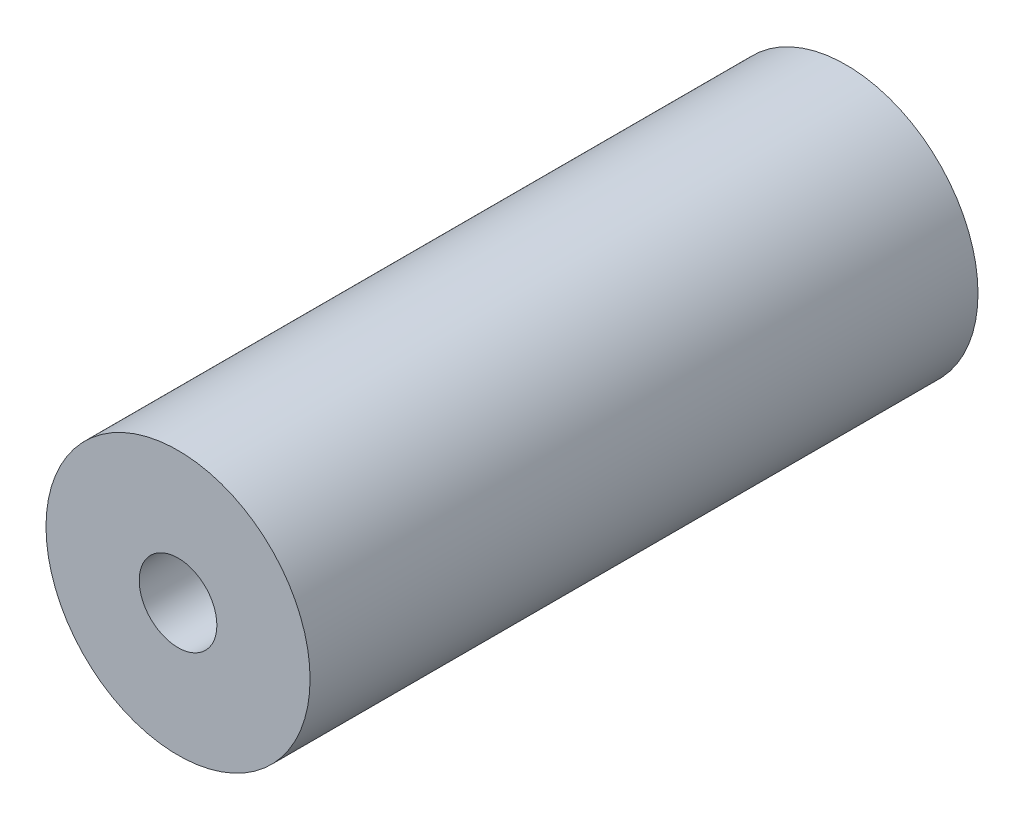
ISO-10303-21;
HEADER;
FILE_DESCRIPTION(('STEP AP214'),'2;1');
FILE_NAME('part.step','',(''),(''),'','','');
FILE_SCHEMA(('AUTOMOTIVE_DESIGN { 1 0 10303 214 1 1 1 1 }'));
ENDSEC;
DATA;
#1=APPLICATION_CONTEXT('core data for automotive mechanical design processes');
#2=APPLICATION_PROTOCOL_DEFINITION('international standard','automotive_design',2000,#1);
#3=PRODUCT_CONTEXT('',#1,'mechanical');
#4=PRODUCT('Part','Part','',(#3));
#5=PRODUCT_RELATED_PRODUCT_CATEGORY('part','',(#4));
#6=PRODUCT_DEFINITION_FORMATION('','',#4);
#7=PRODUCT_DEFINITION_CONTEXT('part definition',#1,'design');
#8=PRODUCT_DEFINITION('design','',#6,#7);
#9=PRODUCT_DEFINITION_SHAPE('','',#8);
#10=(LENGTH_UNIT() NAMED_UNIT(*) SI_UNIT(.MILLI.,.METRE.));
#11=(NAMED_UNIT(*) PLANE_ANGLE_UNIT() SI_UNIT($,.RADIAN.));
#12=(NAMED_UNIT(*) SI_UNIT($,.STERADIAN.) SOLID_ANGLE_UNIT());
#13=UNCERTAINTY_MEASURE_WITH_UNIT(LENGTH_MEASURE(1.E-05),#10,'distance_accuracy_value','');
#14=(GEOMETRIC_REPRESENTATION_CONTEXT(3) GLOBAL_UNCERTAINTY_ASSIGNED_CONTEXT((#13)) GLOBAL_UNIT_ASSIGNED_CONTEXT((#10,
#11,#12)) REPRESENTATION_CONTEXT('',''));
#15=CARTESIAN_POINT('',(0.,0.,0.));
#16=DIRECTION('',(0.,0.,1.));
#17=DIRECTION('',(1.,0.,0.));
#18=AXIS2_PLACEMENT_3D('',#15,#16,#17);
#19=CARTESIAN_POINT('',(0.,0.,43.));
#20=DIRECTION('',(0.,0.,1.));
#21=DIRECTION('',(1.,0.,0.));
#22=AXIS2_PLACEMENT_3D('',#19,#20,#21);
#23=PLANE('',#22);
#24=CARTESIAN_POINT('',(0.,0.,43.));
#25=DIRECTION('',(0.,0.,1.));
#26=DIRECTION('',(1.,0.,0.));
#27=AXIS2_PLACEMENT_3D('',#24,#25,#26);
#28=CIRCLE('',#27,17.);
#29=CARTESIAN_POINT('',(17.,0.,43.));
#30=VERTEX_POINT('',#29);
#31=EDGE_CURVE('E10',#30,#30,#28,.T.);
#32=ORIENTED_EDGE('',*,*,#31,.T.);
#33=EDGE_LOOP('',(#32));
#34=FACE_BOUND('',#33,.T.);
#35=CARTESIAN_POINT('',(0.,0.,43.));
#36=DIRECTION('',(0.,0.,1.));
#37=DIRECTION('',(1.,0.,0.));
#38=AXIS2_PLACEMENT_3D('',#35,#36,#37);
#39=CIRCLE('',#38,5.);
#40=CARTESIAN_POINT('',(5.,0.,43.));
#41=VERTEX_POINT('',#40);
#42=EDGE_CURVE('E50',#41,#41,#39,.T.);
#43=ORIENTED_EDGE('',*,*,#42,.F.);
#44=EDGE_LOOP('',(#43));
#45=FACE_BOUND('',#44,.T.);
#46=ADVANCED_FACE('F37',(#34,#45),#23,.T.);
#47=CARTESIAN_POINT('',(0.,0.,-43.));
#48=DIRECTION('',(0.,0.,1.));
#49=DIRECTION('',(1.,0.,0.));
#50=AXIS2_PLACEMENT_3D('',#47,#48,#49);
#51=PLANE('',#50);
#52=CARTESIAN_POINT('',(0.,0.,-43.));
#53=DIRECTION('',(0.,0.,1.));
#54=DIRECTION('',(1.,0.,0.));
#55=AXIS2_PLACEMENT_3D('',#52,#53,#54);
#56=CIRCLE('',#55,17.);
#57=CARTESIAN_POINT('',(17.,0.,-43.));
#58=VERTEX_POINT('',#57);
#59=EDGE_CURVE('E41',#58,#58,#56,.T.);
#60=ORIENTED_EDGE('',*,*,#59,.F.);
#61=EDGE_LOOP('',(#60));
#62=FACE_BOUND('',#61,.T.);
#63=CARTESIAN_POINT('',(0.,0.,-43.));
#64=DIRECTION('',(0.,0.,1.));
#65=DIRECTION('',(1.,0.,0.));
#66=AXIS2_PLACEMENT_3D('',#63,#64,#65);
#67=CIRCLE('',#66,5.);
#68=CARTESIAN_POINT('',(5.,0.,-43.));
#69=VERTEX_POINT('',#68);
#70=EDGE_CURVE('E52',#69,#69,#67,.T.);
#71=ORIENTED_EDGE('',*,*,#70,.T.);
#72=EDGE_LOOP('',(#71));
#73=FACE_BOUND('',#72,.T.);
#74=ADVANCED_FACE('F64',(#62,#73),#51,.F.);
#75=CARTESIAN_POINT('',(0.,0.,43.));
#76=DIRECTION('',(0.,0.,-1.));
#77=DIRECTION('',(-1.,0.,0.));
#78=AXIS2_PLACEMENT_3D('',#75,#76,#77);
#79=CYLINDRICAL_SURFACE('',#78,17.);
#80=ORIENTED_EDGE('',*,*,#31,.F.);
#81=EDGE_LOOP('',(#80));
#82=FACE_BOUND('',#81,.T.);
#83=ORIENTED_EDGE('',*,*,#59,.T.);
#84=EDGE_LOOP('',(#83));
#85=FACE_BOUND('',#84,.T.);
#86=ADVANCED_FACE('F39',(#82,#85),#79,.T.);
#87=CARTESIAN_POINT('',(0.,0.,43.));
#88=DIRECTION('',(0.,0.,-1.));
#89=DIRECTION('',(-1.,0.,0.));
#90=AXIS2_PLACEMENT_3D('',#87,#88,#89);
#91=CYLINDRICAL_SURFACE('',#90,5.);
#92=ORIENTED_EDGE('',*,*,#42,.T.);
#93=EDGE_LOOP('',(#92));
#94=FACE_BOUND('',#93,.T.);
#95=ORIENTED_EDGE('',*,*,#70,.F.);
#96=EDGE_LOOP('',(#95));
#97=FACE_BOUND('',#96,.T.);
#98=ADVANCED_FACE('F60',(#94,#97),#91,.F.);
#99=CLOSED_SHELL('',(#46,#74,#86,#98));
#100=MANIFOLD_SOLID_BREP('B2',#99);
#101=ADVANCED_BREP_SHAPE_REPRESENTATION('',(#18,#100),#14);
#102=SHAPE_DEFINITION_REPRESENTATION(#9,#101);
ENDSEC;
END-ISO-10303-21;
